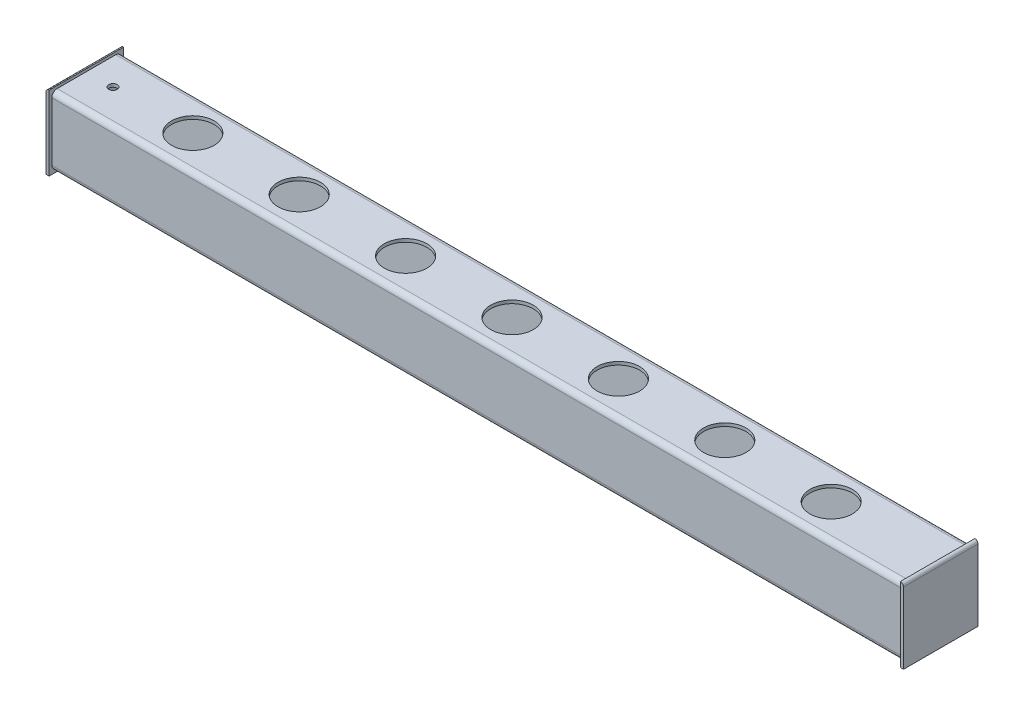
ISO-10303-21;
HEADER;
FILE_DESCRIPTION(('STEP AP214'),'2;1');
FILE_NAME('part.step','',(''),(''),'','','');
FILE_SCHEMA(('AUTOMOTIVE_DESIGN { 1 0 10303 214 1 1 1 1 }'));
ENDSEC;
DATA;
#1=APPLICATION_CONTEXT('core data for automotive mechanical design processes');
#2=APPLICATION_PROTOCOL_DEFINITION('international standard','automotive_design',2000,#1);
#3=PRODUCT_CONTEXT('',#1,'mechanical');
#4=PRODUCT('Part','Part','',(#3));
#5=PRODUCT_RELATED_PRODUCT_CATEGORY('part','',(#4));
#6=PRODUCT_DEFINITION_FORMATION('','',#4);
#7=PRODUCT_DEFINITION_CONTEXT('part definition',#1,'design');
#8=PRODUCT_DEFINITION('design','',#6,#7);
#9=PRODUCT_DEFINITION_SHAPE('','',#8);
#10=(LENGTH_UNIT() NAMED_UNIT(*) SI_UNIT(.MILLI.,.METRE.));
#11=(NAMED_UNIT(*) PLANE_ANGLE_UNIT() SI_UNIT($,.RADIAN.));
#12=(NAMED_UNIT(*) SI_UNIT($,.STERADIAN.) SOLID_ANGLE_UNIT());
#13=UNCERTAINTY_MEASURE_WITH_UNIT(LENGTH_MEASURE(1.E-05),#10,'distance_accuracy_value','');
#14=(GEOMETRIC_REPRESENTATION_CONTEXT(3) GLOBAL_UNCERTAINTY_ASSIGNED_CONTEXT((#13)) GLOBAL_UNIT_ASSIGNED_CONTEXT((#10,
#11,#12)) REPRESENTATION_CONTEXT('',''));
#15=CARTESIAN_POINT('',(0.,0.,0.));
#16=DIRECTION('',(0.,0.,1.));
#17=DIRECTION('',(1.,0.,0.));
#18=AXIS2_PLACEMENT_3D('',#15,#16,#17);
#19=CARTESIAN_POINT('',(-400.,0.,0.));
#20=DIRECTION('',(-1.,0.,0.));
#21=DIRECTION('',(0.,0.,1.));
#22=AXIS2_PLACEMENT_3D('',#19,#20,#21);
#23=PLANE('',#22);
#24=DIRECTION('',(0.,1.,0.));
#25=VECTOR('',#24,1.);
#26=CARTESIAN_POINT('',(-400.,-32.5,-32.5));
#27=LINE('',#26,#25);
#28=CARTESIAN_POINT('',(-400.,-27.5,-32.5));
#29=VERTEX_POINT('',#28);
#30=CARTESIAN_POINT('',(-400.,27.5,-32.5));
#31=VERTEX_POINT('',#30);
#32=EDGE_CURVE('E253',#29,#31,#27,.T.);
#33=ORIENTED_EDGE('',*,*,#32,.F.);
#34=CARTESIAN_POINT('',(-400.,-27.5,-27.5));
#35=DIRECTION('',(-1.,0.,0.));
#36=DIRECTION('',(0.,0.,1.));
#37=AXIS2_PLACEMENT_3D('',#34,#35,#36);
#38=CIRCLE('',#37,5.);
#39=CARTESIAN_POINT('',(-400.,-32.5,-27.5));
#40=VERTEX_POINT('',#39);
#41=EDGE_CURVE('E275',#29,#40,#38,.T.);
#42=ORIENTED_EDGE('',*,*,#41,.T.);
#43=DIRECTION('',(0.,0.,-1.));
#44=VECTOR('',#43,1.);
#45=CARTESIAN_POINT('',(-400.,-32.5,32.5));
#46=LINE('',#45,#44);
#47=CARTESIAN_POINT('',(-400.,-32.5,27.5));
#48=VERTEX_POINT('',#47);
#49=EDGE_CURVE('E243',#48,#40,#46,.T.);
#50=ORIENTED_EDGE('',*,*,#49,.F.);
#51=CARTESIAN_POINT('',(-400.,-27.5,27.5));
#52=DIRECTION('',(-1.,0.,0.));
#53=DIRECTION('',(0.,0.,1.));
#54=AXIS2_PLACEMENT_3D('',#51,#52,#53);
#55=CIRCLE('',#54,5.);
#56=CARTESIAN_POINT('',(-400.,-27.5,32.5));
#57=VERTEX_POINT('',#56);
#58=EDGE_CURVE('E273',#48,#57,#55,.T.);
#59=ORIENTED_EDGE('',*,*,#58,.T.);
#60=DIRECTION('',(0.,-1.,0.));
#61=VECTOR('',#60,1.);
#62=CARTESIAN_POINT('',(-400.,-32.5,32.5));
#63=LINE('',#62,#61);
#64=CARTESIAN_POINT('',(-400.,27.5,32.5));
#65=VERTEX_POINT('',#64);
#66=EDGE_CURVE('E260',#65,#57,#63,.T.);
#67=ORIENTED_EDGE('',*,*,#66,.F.);
#68=CARTESIAN_POINT('',(-400.,27.5,27.5));
#69=DIRECTION('',(-1.,0.,0.));
#70=DIRECTION('',(0.,0.,1.));
#71=AXIS2_PLACEMENT_3D('',#68,#69,#70);
#72=CIRCLE('',#71,5.);
#73=CARTESIAN_POINT('',(-400.,32.5,27.5));
#74=VERTEX_POINT('',#73);
#75=EDGE_CURVE('E269',#65,#74,#72,.T.);
#76=ORIENTED_EDGE('',*,*,#75,.T.);
#77=DIRECTION('',(0.,0.,1.));
#78=VECTOR('',#77,1.);
#79=CARTESIAN_POINT('',(-400.,32.5,32.5));
#80=LINE('',#79,#78);
#81=CARTESIAN_POINT('',(-400.,32.5,-27.5));
#82=VERTEX_POINT('',#81);
#83=EDGE_CURVE('E256',#82,#74,#80,.T.);
#84=ORIENTED_EDGE('',*,*,#83,.F.);
#85=CARTESIAN_POINT('',(-400.,27.5,-27.5));
#86=DIRECTION('',(-1.,0.,0.));
#87=DIRECTION('',(0.,0.,1.));
#88=AXIS2_PLACEMENT_3D('',#85,#86,#87);
#89=CIRCLE('',#88,5.);
#90=EDGE_CURVE('E271',#82,#31,#89,.T.);
#91=ORIENTED_EDGE('',*,*,#90,.T.);
#92=EDGE_LOOP('',(#33,#42,#50,#59,#67,#76,#84,#91));
#93=FACE_BOUND('',#92,.T.);
#94=CARTESIAN_POINT('',(-400.,-27.5,-27.5));
#95=DIRECTION('',(-1.,0.,0.));
#96=DIRECTION('',(0.,0.,1.));
#97=AXIS2_PLACEMENT_3D('',#94,#95,#96);
#98=CIRCLE('',#97,2.);
#99=CARTESIAN_POINT('',(-400.,-27.5,-29.5));
#100=VERTEX_POINT('',#99);
#101=CARTESIAN_POINT('',(-400.,-29.5,-27.5));
#102=VERTEX_POINT('',#101);
#103=EDGE_CURVE('E225',#100,#102,#98,.T.);
#104=ORIENTED_EDGE('',*,*,#103,.F.);
#105=DIRECTION('',(0.,1.,0.));
#106=VECTOR('',#105,1.);
#107=CARTESIAN_POINT('',(-400.,0.,-29.5));
#108=LINE('',#107,#106);
#109=CARTESIAN_POINT('',(-400.,27.5,-29.5));
#110=VERTEX_POINT('',#109);
#111=EDGE_CURVE('E222',#100,#110,#108,.T.);
#112=ORIENTED_EDGE('',*,*,#111,.T.);
#113=CARTESIAN_POINT('',(-400.,27.5,-27.5));
#114=DIRECTION('',(-1.,0.,0.));
#115=DIRECTION('',(0.,0.,1.));
#116=AXIS2_PLACEMENT_3D('',#113,#114,#115);
#117=CIRCLE('',#116,2.);
#118=CARTESIAN_POINT('',(-400.,29.5,-27.5));
#119=VERTEX_POINT('',#118);
#120=EDGE_CURVE('E185',#119,#110,#117,.T.);
#121=ORIENTED_EDGE('',*,*,#120,.F.);
#122=DIRECTION('',(0.,0.,1.));
#123=VECTOR('',#122,1.);
#124=CARTESIAN_POINT('',(-400.,29.5,0.));
#125=LINE('',#124,#123);
#126=CARTESIAN_POINT('',(-400.,29.5,27.5));
#127=VERTEX_POINT('',#126);
#128=EDGE_CURVE('E86',#119,#127,#125,.T.);
#129=ORIENTED_EDGE('',*,*,#128,.T.);
#130=CARTESIAN_POINT('',(-400.,27.5,27.5));
#131=DIRECTION('',(-1.,0.,0.));
#132=DIRECTION('',(0.,0.,1.));
#133=AXIS2_PLACEMENT_3D('',#130,#131,#132);
#134=CIRCLE('',#133,2.);
#135=CARTESIAN_POINT('',(-400.,27.5,29.5));
#136=VERTEX_POINT('',#135);
#137=EDGE_CURVE('E235',#136,#127,#134,.T.);
#138=ORIENTED_EDGE('',*,*,#137,.F.);
#139=DIRECTION('',(0.,-1.,0.));
#140=VECTOR('',#139,1.);
#141=CARTESIAN_POINT('',(-400.,0.,29.5));
#142=LINE('',#141,#140);
#143=CARTESIAN_POINT('',(-400.,-27.5,29.5));
#144=VERTEX_POINT('',#143);
#145=EDGE_CURVE('E231',#136,#144,#142,.T.);
#146=ORIENTED_EDGE('',*,*,#145,.T.);
#147=CARTESIAN_POINT('',(-400.,-27.5,27.5));
#148=DIRECTION('',(-1.,0.,0.));
#149=DIRECTION('',(0.,0.,1.));
#150=AXIS2_PLACEMENT_3D('',#147,#148,#149);
#151=CIRCLE('',#150,2.);
#152=CARTESIAN_POINT('',(-400.,-29.5,27.5));
#153=VERTEX_POINT('',#152);
#154=EDGE_CURVE('E228',#153,#144,#151,.T.);
#155=ORIENTED_EDGE('',*,*,#154,.F.);
#156=DIRECTION('',(0.,0.,-1.));
#157=VECTOR('',#156,1.);
#158=CARTESIAN_POINT('',(-400.,-29.5,0.));
#159=LINE('',#158,#157);
#160=EDGE_CURVE('E199',#153,#102,#159,.T.);
#161=ORIENTED_EDGE('',*,*,#160,.T.);
#162=EDGE_LOOP('',(#104,#112,#121,#129,#138,#146,#155,#161));
#163=FACE_BOUND('',#162,.T.);
#164=ADVANCED_FACE('F62',(#93,#163),#23,.T.);
#165=CARTESIAN_POINT('',(400.,-32.5,-32.5));
#166=DIRECTION('',(0.,0.,1.));
#167=DIRECTION('',(1.,0.,0.));
#168=AXIS2_PLACEMENT_3D('',#165,#166,#167);
#169=PLANE('',#168);
#170=DIRECTION('',(0.,1.,0.));
#171=VECTOR('',#170,1.);
#172=CARTESIAN_POINT('',(400.,-32.5,-32.5));
#173=LINE('',#172,#171);
#174=CARTESIAN_POINT('',(400.,-27.5,-32.5));
#175=VERTEX_POINT('',#174);
#176=CARTESIAN_POINT('',(400.,27.5,-32.5));
#177=VERTEX_POINT('',#176);
#178=EDGE_CURVE('E239',#175,#177,#173,.T.);
#179=ORIENTED_EDGE('',*,*,#178,.F.);
#180=DIRECTION('',(-1.,0.,0.));
#181=VECTOR('',#180,1.);
#182=CARTESIAN_POINT('',(400.,-27.5,-32.5));
#183=LINE('',#182,#181);
#184=EDGE_CURVE('E266',#175,#29,#183,.T.);
#185=ORIENTED_EDGE('',*,*,#184,.T.);
#186=ORIENTED_EDGE('',*,*,#32,.T.);
#187=DIRECTION('',(-1.,0.,0.));
#188=VECTOR('',#187,1.);
#189=CARTESIAN_POINT('',(400.,27.5,-32.5));
#190=LINE('',#189,#188);
#191=EDGE_CURVE('E252',#31,#177,#190,.F.);
#192=ORIENTED_EDGE('',*,*,#191,.T.);
#193=EDGE_LOOP('',(#179,#185,#186,#192));
#194=FACE_BOUND('',#193,.T.);
#195=ADVANCED_FACE('F328',(#194),#169,.F.);
#196=CARTESIAN_POINT('',(400.,32.5,32.5));
#197=DIRECTION('',(0.,-1.,0.));
#198=DIRECTION('',(0.,0.,-1.));
#199=AXIS2_PLACEMENT_3D('',#196,#197,#198);
#200=PLANE('',#199);
#201=CARTESIAN_POINT('',(-375.,32.5,0.));
#202=DIRECTION('',(0.,1.,0.));
#203=DIRECTION('',(0.,0.,1.));
#204=AXIS2_PLACEMENT_3D('',#201,#202,#203);
#205=CIRCLE('',#204,3.99999999999999);
#206=CARTESIAN_POINT('',(-375.,32.5,3.99999999999999));
#207=VERTEX_POINT('',#206);
#208=EDGE_CURVE('E577',#207,#207,#205,.T.);
#209=ORIENTED_EDGE('',*,*,#208,.F.);
#210=EDGE_LOOP('',(#209));
#211=FACE_BOUND('',#210,.T.);
#212=CARTESIAN_POINT('',(300.,32.5,0.));
#213=DIRECTION('',(0.,1.,0.));
#214=DIRECTION('',(0.,0.,1.));
#215=AXIS2_PLACEMENT_3D('',#212,#213,#214);
#216=CIRCLE('',#215,20.);
#217=CARTESIAN_POINT('',(300.,32.5,20.));
#218=VERTEX_POINT('',#217);
#219=EDGE_CURVE('E606',#218,#218,#216,.T.);
#220=ORIENTED_EDGE('',*,*,#219,.F.);
#221=EDGE_LOOP('',(#220));
#222=FACE_BOUND('',#221,.T.);
#223=CARTESIAN_POINT('',(200.,32.5,0.));
#224=DIRECTION('',(0.,1.,0.));
#225=DIRECTION('',(0.,0.,1.));
#226=AXIS2_PLACEMENT_3D('',#223,#224,#225);
#227=CIRCLE('',#226,20.);
#228=CARTESIAN_POINT('',(200.,32.5,20.));
#229=VERTEX_POINT('',#228);
#230=EDGE_CURVE('E600',#229,#229,#227,.T.);
#231=ORIENTED_EDGE('',*,*,#230,.F.);
#232=EDGE_LOOP('',(#231));
#233=FACE_BOUND('',#232,.T.);
#234=CARTESIAN_POINT('',(100.,32.5,0.));
#235=DIRECTION('',(0.,1.,0.));
#236=DIRECTION('',(0.,0.,1.));
#237=AXIS2_PLACEMENT_3D('',#234,#235,#236);
#238=CIRCLE('',#237,20.);
#239=CARTESIAN_POINT('',(100.,32.5,20.));
#240=VERTEX_POINT('',#239);
#241=EDGE_CURVE('E594',#240,#240,#238,.T.);
#242=ORIENTED_EDGE('',*,*,#241,.F.);
#243=EDGE_LOOP('',(#242));
#244=FACE_BOUND('',#243,.T.);
#245=CARTESIAN_POINT('',(-300.,32.5,0.));
#246=DIRECTION('',(0.,1.,0.));
#247=DIRECTION('',(0.,0.,1.));
#248=AXIS2_PLACEMENT_3D('',#245,#246,#247);
#249=CIRCLE('',#248,20.);
#250=CARTESIAN_POINT('',(-300.,32.5,20.));
#251=VERTEX_POINT('',#250);
#252=EDGE_CURVE('E587',#251,#251,#249,.T.);
#253=ORIENTED_EDGE('',*,*,#252,.F.);
#254=EDGE_LOOP('',(#253));
#255=FACE_BOUND('',#254,.T.);
#256=CARTESIAN_POINT('',(-200.,32.5,0.));
#257=DIRECTION('',(0.,1.,0.));
#258=DIRECTION('',(0.,0.,1.));
#259=AXIS2_PLACEMENT_3D('',#256,#257,#258);
#260=CIRCLE('',#259,20.);
#261=CARTESIAN_POINT('',(-200.,32.5,20.));
#262=VERTEX_POINT('',#261);
#263=EDGE_CURVE('E586',#262,#262,#260,.T.);
#264=ORIENTED_EDGE('',*,*,#263,.F.);
#265=EDGE_LOOP('',(#264));
#266=FACE_BOUND('',#265,.T.);
#267=CARTESIAN_POINT('',(-100.,32.5,0.));
#268=DIRECTION('',(0.,1.,0.));
#269=DIRECTION('',(0.,0.,1.));
#270=AXIS2_PLACEMENT_3D('',#267,#268,#269);
#271=CIRCLE('',#270,20.);
#272=CARTESIAN_POINT('',(-100.,32.5,20.));
#273=VERTEX_POINT('',#272);
#274=EDGE_CURVE('E615',#273,#273,#271,.T.);
#275=ORIENTED_EDGE('',*,*,#274,.F.);
#276=EDGE_LOOP('',(#275));
#277=FACE_BOUND('',#276,.T.);
#278=CARTESIAN_POINT('',(0.,32.5,0.));
#279=DIRECTION('',(0.,1.,0.));
#280=DIRECTION('',(0.,0.,1.));
#281=AXIS2_PLACEMENT_3D('',#278,#279,#280);
#282=CIRCLE('',#281,20.);
#283=CARTESIAN_POINT('',(0.,32.5,20.));
#284=VERTEX_POINT('',#283);
#285=EDGE_CURVE('E224',#284,#284,#282,.T.);
#286=ORIENTED_EDGE('',*,*,#285,.F.);
#287=EDGE_LOOP('',(#286));
#288=FACE_BOUND('',#287,.T.);
#289=DIRECTION('',(0.,0.,1.));
#290=VECTOR('',#289,1.);
#291=CARTESIAN_POINT('',(400.,32.5,32.5));
#292=LINE('',#291,#290);
#293=CARTESIAN_POINT('',(400.,32.5,-27.5));
#294=VERTEX_POINT('',#293);
#295=CARTESIAN_POINT('',(400.,32.5,27.5));
#296=VERTEX_POINT('',#295);
#297=EDGE_CURVE('E242',#294,#296,#292,.T.);
#298=ORIENTED_EDGE('',*,*,#297,.F.);
#299=DIRECTION('',(-1.,0.,0.));
#300=VECTOR('',#299,1.);
#301=CARTESIAN_POINT('',(400.,32.5,-27.5));
#302=LINE('',#301,#300);
#303=EDGE_CURVE('E14',#294,#82,#302,.T.);
#304=ORIENTED_EDGE('',*,*,#303,.T.);
#305=ORIENTED_EDGE('',*,*,#83,.T.);
#306=DIRECTION('',(-1.,0.,0.));
#307=VECTOR('',#306,1.);
#308=CARTESIAN_POINT('',(400.,32.5,27.5));
#309=LINE('',#308,#307);
#310=EDGE_CURVE('E71',#74,#296,#309,.F.);
#311=ORIENTED_EDGE('',*,*,#310,.T.);
#312=EDGE_LOOP('',(#298,#304,#305,#311));
#313=FACE_BOUND('',#312,.T.);
#314=ADVANCED_FACE('F298',(#211,#222,#233,#244,#255,#266,#277,#288,#313),#200,.F.);
#315=CARTESIAN_POINT('',(400.,-32.5,32.5));
#316=DIRECTION('',(0.,0.,-1.));
#317=DIRECTION('',(-1.,0.,0.));
#318=AXIS2_PLACEMENT_3D('',#315,#316,#317);
#319=PLANE('',#318);
#320=ORIENTED_EDGE('',*,*,#66,.T.);
#321=DIRECTION('',(-1.,0.,0.));
#322=VECTOR('',#321,1.);
#323=CARTESIAN_POINT('',(400.,-27.5,32.5));
#324=LINE('',#323,#322);
#325=CARTESIAN_POINT('',(400.,-27.5,32.5));
#326=VERTEX_POINT('',#325);
#327=EDGE_CURVE('E293',#57,#326,#324,.F.);
#328=ORIENTED_EDGE('',*,*,#327,.T.);
#329=DIRECTION('',(0.,-1.,0.));
#330=VECTOR('',#329,1.);
#331=CARTESIAN_POINT('',(400.,-32.5,32.5));
#332=LINE('',#331,#330);
#333=CARTESIAN_POINT('',(400.,27.5,32.5));
#334=VERTEX_POINT('',#333);
#335=EDGE_CURVE('E246',#334,#326,#332,.T.);
#336=ORIENTED_EDGE('',*,*,#335,.F.);
#337=DIRECTION('',(-1.,0.,0.));
#338=VECTOR('',#337,1.);
#339=CARTESIAN_POINT('',(400.,27.5,32.5));
#340=LINE('',#339,#338);
#341=EDGE_CURVE('E290',#334,#65,#340,.T.);
#342=ORIENTED_EDGE('',*,*,#341,.T.);
#343=EDGE_LOOP('',(#320,#328,#336,#342));
#344=FACE_BOUND('',#343,.T.);
#345=ADVANCED_FACE('F308',(#344),#319,.F.);
#346=CARTESIAN_POINT('',(400.,-32.5,32.5));
#347=DIRECTION('',(0.,1.,0.));
#348=DIRECTION('',(0.,0.,1.));
#349=AXIS2_PLACEMENT_3D('',#346,#347,#348);
#350=PLANE('',#349);
#351=CARTESIAN_POINT('',(-375.,-32.5,0.));
#352=DIRECTION('',(0.,1.,0.));
#353=DIRECTION('',(0.,0.,1.));
#354=AXIS2_PLACEMENT_3D('',#351,#352,#353);
#355=CIRCLE('',#354,2.);
#356=CARTESIAN_POINT('',(-375.,-32.5,2.));
#357=VERTEX_POINT('',#356);
#358=EDGE_CURVE('E573',#357,#357,#355,.T.);
#359=ORIENTED_EDGE('',*,*,#358,.T.);
#360=EDGE_LOOP('',(#359));
#361=FACE_BOUND('',#360,.T.);
#362=ORIENTED_EDGE('',*,*,#49,.T.);
#363=DIRECTION('',(-1.,0.,0.));
#364=VECTOR('',#363,1.);
#365=CARTESIAN_POINT('',(400.,-32.5,-27.5));
#366=LINE('',#365,#364);
#367=CARTESIAN_POINT('',(400.,-32.5,-27.5));
#368=VERTEX_POINT('',#367);
#369=EDGE_CURVE('E280',#40,#368,#366,.F.);
#370=ORIENTED_EDGE('',*,*,#369,.T.);
#371=DIRECTION('',(0.,0.,-1.));
#372=VECTOR('',#371,1.);
#373=CARTESIAN_POINT('',(400.,-32.5,32.5));
#374=LINE('',#373,#372);
#375=CARTESIAN_POINT('',(400.,-32.5,27.5));
#376=VERTEX_POINT('',#375);
#377=EDGE_CURVE('E249',#376,#368,#374,.T.);
#378=ORIENTED_EDGE('',*,*,#377,.F.);
#379=DIRECTION('',(-1.,0.,0.));
#380=VECTOR('',#379,1.);
#381=CARTESIAN_POINT('',(400.,-32.5,27.5));
#382=LINE('',#381,#380);
#383=EDGE_CURVE('E277',#376,#48,#382,.T.);
#384=ORIENTED_EDGE('',*,*,#383,.T.);
#385=EDGE_LOOP('',(#362,#370,#378,#384));
#386=FACE_BOUND('',#385,.T.);
#387=ADVANCED_FACE('F320',(#361,#386),#350,.F.);
#388=CARTESIAN_POINT('',(400.,0.,0.));
#389=DIRECTION('',(-1.,0.,0.));
#390=DIRECTION('',(0.,0.,1.));
#391=AXIS2_PLACEMENT_3D('',#388,#389,#390);
#392=PLANE('',#391);
#393=DIRECTION('',(0.,0.,-1.));
#394=VECTOR('',#393,1.);
#395=CARTESIAN_POINT('',(400.,-29.5,0.));
#396=LINE('',#395,#394);
#397=CARTESIAN_POINT('',(400.,-29.5,27.5));
#398=VERTEX_POINT('',#397);
#399=CARTESIAN_POINT('',(400.,-29.5,-27.5));
#400=VERTEX_POINT('',#399);
#401=EDGE_CURVE('E190',#398,#400,#396,.T.);
#402=ORIENTED_EDGE('',*,*,#401,.F.);
#403=CARTESIAN_POINT('',(400.,-27.5,27.5));
#404=DIRECTION('',(-1.,0.,0.));
#405=DIRECTION('',(0.,0.,1.));
#406=AXIS2_PLACEMENT_3D('',#403,#404,#405);
#407=CIRCLE('',#406,2.);
#408=CARTESIAN_POINT('',(400.,-27.5,29.5));
#409=VERTEX_POINT('',#408);
#410=EDGE_CURVE('E207',#409,#398,#407,.F.);
#411=ORIENTED_EDGE('',*,*,#410,.F.);
#412=DIRECTION('',(0.,-1.,0.));
#413=VECTOR('',#412,1.);
#414=CARTESIAN_POINT('',(400.,0.,29.5));
#415=LINE('',#414,#413);
#416=CARTESIAN_POINT('',(400.,27.5,29.5));
#417=VERTEX_POINT('',#416);
#418=EDGE_CURVE('E78',#417,#409,#415,.T.);
#419=ORIENTED_EDGE('',*,*,#418,.F.);
#420=CARTESIAN_POINT('',(400.,27.5,27.5));
#421=DIRECTION('',(-1.,0.,0.));
#422=DIRECTION('',(0.,0.,1.));
#423=AXIS2_PLACEMENT_3D('',#420,#421,#422);
#424=CIRCLE('',#423,2.);
#425=CARTESIAN_POINT('',(400.,29.5,27.5));
#426=VERTEX_POINT('',#425);
#427=EDGE_CURVE('E208',#426,#417,#424,.F.);
#428=ORIENTED_EDGE('',*,*,#427,.F.);
#429=DIRECTION('',(0.,0.,1.));
#430=VECTOR('',#429,1.);
#431=CARTESIAN_POINT('',(400.,29.5,0.));
#432=LINE('',#431,#430);
#433=CARTESIAN_POINT('',(400.,29.5,-27.5));
#434=VERTEX_POINT('',#433);
#435=EDGE_CURVE('E198',#434,#426,#432,.T.);
#436=ORIENTED_EDGE('',*,*,#435,.F.);
#437=CARTESIAN_POINT('',(400.,27.5,-27.5));
#438=DIRECTION('',(-1.,0.,0.));
#439=DIRECTION('',(0.,0.,1.));
#440=AXIS2_PLACEMENT_3D('',#437,#438,#439);
#441=CIRCLE('',#440,2.);
#442=CARTESIAN_POINT('',(400.,27.5,-29.5));
#443=VERTEX_POINT('',#442);
#444=EDGE_CURVE('E183',#443,#434,#441,.F.);
#445=ORIENTED_EDGE('',*,*,#444,.F.);
#446=DIRECTION('',(0.,1.,0.));
#447=VECTOR('',#446,1.);
#448=CARTESIAN_POINT('',(400.,0.,-29.5));
#449=LINE('',#448,#447);
#450=CARTESIAN_POINT('',(400.,-27.5,-29.5));
#451=VERTEX_POINT('',#450);
#452=EDGE_CURVE('E194',#451,#443,#449,.T.);
#453=ORIENTED_EDGE('',*,*,#452,.F.);
#454=CARTESIAN_POINT('',(400.,-27.5,-27.5));
#455=DIRECTION('',(-1.,0.,0.));
#456=DIRECTION('',(0.,0.,1.));
#457=AXIS2_PLACEMENT_3D('',#454,#455,#456);
#458=CIRCLE('',#457,2.);
#459=EDGE_CURVE('E210',#400,#451,#458,.F.);
#460=ORIENTED_EDGE('',*,*,#459,.F.);
#461=EDGE_LOOP('',(#402,#411,#419,#428,#436,#445,#453,#460));
#462=FACE_BOUND('',#461,.T.);
#463=ORIENTED_EDGE('',*,*,#377,.T.);
#464=CARTESIAN_POINT('',(400.,-27.5,-27.5));
#465=DIRECTION('',(-1.,0.,0.));
#466=DIRECTION('',(0.,0.,1.));
#467=AXIS2_PLACEMENT_3D('',#464,#465,#466);
#468=CIRCLE('',#467,5.);
#469=EDGE_CURVE('E288',#368,#175,#468,.F.);
#470=ORIENTED_EDGE('',*,*,#469,.T.);
#471=ORIENTED_EDGE('',*,*,#178,.T.);
#472=CARTESIAN_POINT('',(400.,27.5,-27.5));
#473=DIRECTION('',(-1.,0.,0.));
#474=DIRECTION('',(0.,0.,1.));
#475=AXIS2_PLACEMENT_3D('',#472,#473,#474);
#476=CIRCLE('',#475,5.);
#477=EDGE_CURVE('E284',#177,#294,#476,.F.);
#478=ORIENTED_EDGE('',*,*,#477,.T.);
#479=ORIENTED_EDGE('',*,*,#297,.T.);
#480=CARTESIAN_POINT('',(400.,27.5,27.5));
#481=DIRECTION('',(-1.,0.,0.));
#482=DIRECTION('',(0.,0.,1.));
#483=AXIS2_PLACEMENT_3D('',#480,#481,#482);
#484=CIRCLE('',#483,5.);
#485=EDGE_CURVE('E282',#296,#334,#484,.F.);
#486=ORIENTED_EDGE('',*,*,#485,.T.);
#487=ORIENTED_EDGE('',*,*,#335,.T.);
#488=CARTESIAN_POINT('',(400.,-27.5,27.5));
#489=DIRECTION('',(-1.,0.,0.));
#490=DIRECTION('',(0.,0.,1.));
#491=AXIS2_PLACEMENT_3D('',#488,#489,#490);
#492=CIRCLE('',#491,5.);
#493=EDGE_CURVE('E286',#326,#376,#492,.F.);
#494=ORIENTED_EDGE('',*,*,#493,.T.);
#495=EDGE_LOOP('',(#463,#470,#471,#478,#479,#486,#487,#494));
#496=FACE_BOUND('',#495,.T.);
#497=ADVANCED_FACE('F203',(#462,#496),#392,.F.);
#498=CARTESIAN_POINT('',(400.,-27.5,-27.5));
#499=DIRECTION('',(-1.,0.,0.));
#500=DIRECTION('',(0.,0.,1.));
#501=AXIS2_PLACEMENT_3D('',#498,#499,#500);
#502=CYLINDRICAL_SURFACE('',#501,5.);
#503=ORIENTED_EDGE('',*,*,#469,.F.);
#504=ORIENTED_EDGE('',*,*,#369,.F.);
#505=ORIENTED_EDGE('',*,*,#41,.F.);
#506=ORIENTED_EDGE('',*,*,#184,.F.);
#507=EDGE_LOOP('',(#503,#504,#505,#506));
#508=FACE_BOUND('',#507,.T.);
#509=ADVANCED_FACE('F326',(#508),#502,.T.);
#510=CARTESIAN_POINT('',(400.,-27.5,27.5));
#511=DIRECTION('',(-1.,0.,0.));
#512=DIRECTION('',(0.,0.,1.));
#513=AXIS2_PLACEMENT_3D('',#510,#511,#512);
#514=CYLINDRICAL_SURFACE('',#513,5.);
#515=ORIENTED_EDGE('',*,*,#493,.F.);
#516=ORIENTED_EDGE('',*,*,#327,.F.);
#517=ORIENTED_EDGE('',*,*,#58,.F.);
#518=ORIENTED_EDGE('',*,*,#383,.F.);
#519=EDGE_LOOP('',(#515,#516,#517,#518));
#520=FACE_BOUND('',#519,.T.);
#521=ADVANCED_FACE('F317',(#520),#514,.T.);
#522=CARTESIAN_POINT('',(400.,27.5,-27.5));
#523=DIRECTION('',(-1.,0.,0.));
#524=DIRECTION('',(0.,0.,1.));
#525=AXIS2_PLACEMENT_3D('',#522,#523,#524);
#526=CYLINDRICAL_SURFACE('',#525,5.);
#527=ORIENTED_EDGE('',*,*,#477,.F.);
#528=ORIENTED_EDGE('',*,*,#191,.F.);
#529=ORIENTED_EDGE('',*,*,#90,.F.);
#530=ORIENTED_EDGE('',*,*,#303,.F.);
#531=EDGE_LOOP('',(#527,#528,#529,#530));
#532=FACE_BOUND('',#531,.T.);
#533=ADVANCED_FACE('F331',(#532),#526,.T.);
#534=CARTESIAN_POINT('',(400.,27.5,27.5));
#535=DIRECTION('',(-1.,0.,0.));
#536=DIRECTION('',(0.,0.,1.));
#537=AXIS2_PLACEMENT_3D('',#534,#535,#536);
#538=CYLINDRICAL_SURFACE('',#537,5.);
#539=ORIENTED_EDGE('',*,*,#485,.F.);
#540=ORIENTED_EDGE('',*,*,#310,.F.);
#541=ORIENTED_EDGE('',*,*,#75,.F.);
#542=ORIENTED_EDGE('',*,*,#341,.F.);
#543=EDGE_LOOP('',(#539,#540,#541,#542));
#544=FACE_BOUND('',#543,.T.);
#545=ADVANCED_FACE('F64',(#544),#538,.T.);
#546=CARTESIAN_POINT('',(400.,-32.5,-29.5));
#547=DIRECTION('',(0.,0.,1.));
#548=DIRECTION('',(1.,0.,0.));
#549=AXIS2_PLACEMENT_3D('',#546,#547,#548);
#550=PLANE('',#549);
#551=ORIENTED_EDGE('',*,*,#452,.T.);
#552=DIRECTION('',(1.,0.,0.));
#553=VECTOR('',#552,1.);
#554=CARTESIAN_POINT('',(400.,27.5,-29.5));
#555=LINE('',#554,#553);
#556=EDGE_CURVE('E179',#110,#443,#555,.T.);
#557=ORIENTED_EDGE('',*,*,#556,.F.);
#558=ORIENTED_EDGE('',*,*,#111,.F.);
#559=DIRECTION('',(1.,0.,0.));
#560=VECTOR('',#559,1.);
#561=CARTESIAN_POINT('',(400.,-27.5,-29.5));
#562=LINE('',#561,#560);
#563=EDGE_CURVE('E189',#451,#100,#562,.F.);
#564=ORIENTED_EDGE('',*,*,#563,.F.);
#565=EDGE_LOOP('',(#551,#557,#558,#564));
#566=FACE_BOUND('',#565,.T.);
#567=ADVANCED_FACE('F195',(#566),#550,.T.);
#568=CARTESIAN_POINT('',(400.,29.5,32.5));
#569=DIRECTION('',(0.,-1.,0.));
#570=DIRECTION('',(0.,0.,-1.));
#571=AXIS2_PLACEMENT_3D('',#568,#569,#570);
#572=PLANE('',#571);
#573=CARTESIAN_POINT('',(-375.,29.5,0.));
#574=DIRECTION('',(0.,-1.,0.));
#575=DIRECTION('',(0.,0.,-1.));
#576=AXIS2_PLACEMENT_3D('',#573,#574,#575);
#577=CIRCLE('',#576,3.99999999999999);
#578=CARTESIAN_POINT('',(-375.,29.5,-3.99999999999999));
#579=VERTEX_POINT('',#578);
#580=EDGE_CURVE('E574',#579,#579,#577,.F.);
#581=ORIENTED_EDGE('',*,*,#580,.T.);
#582=EDGE_LOOP('',(#581));
#583=FACE_BOUND('',#582,.T.);
#584=CARTESIAN_POINT('',(300.,29.5,0.));
#585=DIRECTION('',(0.,-1.,0.));
#586=DIRECTION('',(0.,0.,-1.));
#587=AXIS2_PLACEMENT_3D('',#584,#585,#586);
#588=CIRCLE('',#587,20.);
#589=CARTESIAN_POINT('',(300.,29.5,-20.));
#590=VERTEX_POINT('',#589);
#591=EDGE_CURVE('E582',#590,#590,#588,.F.);
#592=ORIENTED_EDGE('',*,*,#591,.T.);
#593=EDGE_LOOP('',(#592));
#594=FACE_BOUND('',#593,.T.);
#595=CARTESIAN_POINT('',(200.,29.5,0.));
#596=DIRECTION('',(0.,-1.,0.));
#597=DIRECTION('',(0.,0.,-1.));
#598=AXIS2_PLACEMENT_3D('',#595,#596,#597);
#599=CIRCLE('',#598,20.);
#600=CARTESIAN_POINT('',(200.,29.5,-20.));
#601=VERTEX_POINT('',#600);
#602=EDGE_CURVE('E603',#601,#601,#599,.F.);
#603=ORIENTED_EDGE('',*,*,#602,.T.);
#604=EDGE_LOOP('',(#603));
#605=FACE_BOUND('',#604,.T.);
#606=CARTESIAN_POINT('',(100.,29.5,0.));
#607=DIRECTION('',(0.,-1.,0.));
#608=DIRECTION('',(0.,0.,-1.));
#609=AXIS2_PLACEMENT_3D('',#606,#607,#608);
#610=CIRCLE('',#609,20.);
#611=CARTESIAN_POINT('',(100.,29.5,-20.));
#612=VERTEX_POINT('',#611);
#613=EDGE_CURVE('E597',#612,#612,#610,.F.);
#614=ORIENTED_EDGE('',*,*,#613,.T.);
#615=EDGE_LOOP('',(#614));
#616=FACE_BOUND('',#615,.T.);
#617=CARTESIAN_POINT('',(-300.,29.5,0.));
#618=DIRECTION('',(0.,-1.,0.));
#619=DIRECTION('',(0.,0.,-1.));
#620=AXIS2_PLACEMENT_3D('',#617,#618,#619);
#621=CIRCLE('',#620,20.);
#622=CARTESIAN_POINT('',(-300.,29.5,-20.));
#623=VERTEX_POINT('',#622);
#624=EDGE_CURVE('E591',#623,#623,#621,.F.);
#625=ORIENTED_EDGE('',*,*,#624,.T.);
#626=EDGE_LOOP('',(#625));
#627=FACE_BOUND('',#626,.T.);
#628=CARTESIAN_POINT('',(-200.,29.5,0.));
#629=DIRECTION('',(0.,-1.,0.));
#630=DIRECTION('',(0.,0.,-1.));
#631=AXIS2_PLACEMENT_3D('',#628,#629,#630);
#632=CIRCLE('',#631,20.);
#633=CARTESIAN_POINT('',(-200.,29.5,-20.));
#634=VERTEX_POINT('',#633);
#635=EDGE_CURVE('E583',#634,#634,#632,.F.);
#636=ORIENTED_EDGE('',*,*,#635,.T.);
#637=EDGE_LOOP('',(#636));
#638=FACE_BOUND('',#637,.T.);
#639=CARTESIAN_POINT('',(-100.,29.5,0.));
#640=DIRECTION('',(0.,-1.,0.));
#641=DIRECTION('',(0.,0.,-1.));
#642=AXIS2_PLACEMENT_3D('',#639,#640,#641);
#643=CIRCLE('',#642,20.);
#644=CARTESIAN_POINT('',(-100.,29.5,-20.));
#645=VERTEX_POINT('',#644);
#646=EDGE_CURVE('E590',#645,#645,#643,.F.);
#647=ORIENTED_EDGE('',*,*,#646,.T.);
#648=EDGE_LOOP('',(#647));
#649=FACE_BOUND('',#648,.T.);
#650=CARTESIAN_POINT('',(0.,29.5,0.));
#651=DIRECTION('',(0.,-1.,0.));
#652=DIRECTION('',(0.,0.,-1.));
#653=AXIS2_PLACEMENT_3D('',#650,#651,#652);
#654=CIRCLE('',#653,20.);
#655=CARTESIAN_POINT('',(0.,29.5,-20.));
#656=VERTEX_POINT('',#655);
#657=EDGE_CURVE('E618',#656,#656,#654,.F.);
#658=ORIENTED_EDGE('',*,*,#657,.T.);
#659=EDGE_LOOP('',(#658));
#660=FACE_BOUND('',#659,.T.);
#661=ORIENTED_EDGE('',*,*,#435,.T.);
#662=DIRECTION('',(1.,0.,0.));
#663=VECTOR('',#662,1.);
#664=CARTESIAN_POINT('',(400.,29.5,27.5));
#665=LINE('',#664,#663);
#666=EDGE_CURVE('E628',#127,#426,#665,.T.);
#667=ORIENTED_EDGE('',*,*,#666,.F.);
#668=ORIENTED_EDGE('',*,*,#128,.F.);
#669=DIRECTION('',(1.,0.,0.));
#670=VECTOR('',#669,1.);
#671=CARTESIAN_POINT('',(400.,29.5,-27.5));
#672=LINE('',#671,#670);
#673=EDGE_CURVE('E257',#434,#119,#672,.F.);
#674=ORIENTED_EDGE('',*,*,#673,.F.);
#675=EDGE_LOOP('',(#661,#667,#668,#674));
#676=FACE_BOUND('',#675,.T.);
#677=ADVANCED_FACE('F410',(#583,#594,#605,#616,#627,#638,#649,#660,#676),#572,.T.);
#678=CARTESIAN_POINT('',(400.,-32.5,29.5));
#679=DIRECTION('',(0.,0.,-1.));
#680=DIRECTION('',(-1.,0.,0.));
#681=AXIS2_PLACEMENT_3D('',#678,#679,#680);
#682=PLANE('',#681);
#683=ORIENTED_EDGE('',*,*,#145,.F.);
#684=DIRECTION('',(-1.,0.,0.));
#685=VECTOR('',#684,1.);
#686=CARTESIAN_POINT('',(400.,27.5,29.5));
#687=LINE('',#686,#685);
#688=EDGE_CURVE('E221',#417,#136,#687,.T.);
#689=ORIENTED_EDGE('',*,*,#688,.F.);
#690=ORIENTED_EDGE('',*,*,#418,.T.);
#691=DIRECTION('',(-1.,0.,0.));
#692=VECTOR('',#691,1.);
#693=CARTESIAN_POINT('',(400.,-27.5,29.5));
#694=LINE('',#693,#692);
#695=EDGE_CURVE('E626',#144,#409,#694,.F.);
#696=ORIENTED_EDGE('',*,*,#695,.F.);
#697=EDGE_LOOP('',(#683,#689,#690,#696));
#698=FACE_BOUND('',#697,.T.);
#699=ADVANCED_FACE('F420',(#698),#682,.T.);
#700=CARTESIAN_POINT('',(400.,-29.5,32.5));
#701=DIRECTION('',(0.,1.,0.));
#702=DIRECTION('',(0.,0.,1.));
#703=AXIS2_PLACEMENT_3D('',#700,#701,#702);
#704=PLANE('',#703);
#705=CARTESIAN_POINT('',(-375.,-29.5,0.));
#706=DIRECTION('',(0.,1.,0.));
#707=DIRECTION('',(0.,0.,1.));
#708=AXIS2_PLACEMENT_3D('',#705,#706,#707);
#709=CIRCLE('',#708,2.);
#710=CARTESIAN_POINT('',(-375.,-29.5,2.));
#711=VERTEX_POINT('',#710);
#712=EDGE_CURVE('E66',#711,#711,#709,.T.);
#713=ORIENTED_EDGE('',*,*,#712,.F.);
#714=EDGE_LOOP('',(#713));
#715=FACE_BOUND('',#714,.T.);
#716=ORIENTED_EDGE('',*,*,#160,.F.);
#717=DIRECTION('',(1.,0.,0.));
#718=VECTOR('',#717,1.);
#719=CARTESIAN_POINT('',(400.,-29.5,27.5));
#720=LINE('',#719,#718);
#721=EDGE_CURVE('E227',#398,#153,#720,.F.);
#722=ORIENTED_EDGE('',*,*,#721,.F.);
#723=ORIENTED_EDGE('',*,*,#401,.T.);
#724=DIRECTION('',(1.,0.,0.));
#725=VECTOR('',#724,1.);
#726=CARTESIAN_POINT('',(400.,-29.5,-27.5));
#727=LINE('',#726,#725);
#728=EDGE_CURVE('E212',#102,#400,#727,.T.);
#729=ORIENTED_EDGE('',*,*,#728,.F.);
#730=EDGE_LOOP('',(#716,#722,#723,#729));
#731=FACE_BOUND('',#730,.T.);
#732=ADVANCED_FACE('F431',(#715,#731),#704,.T.);
#733=CARTESIAN_POINT('',(400.,-27.5,-27.5));
#734=DIRECTION('',(-1.,0.,0.));
#735=DIRECTION('',(0.,0.,1.));
#736=AXIS2_PLACEMENT_3D('',#733,#734,#735);
#737=CYLINDRICAL_SURFACE('',#736,2.);
#738=ORIENTED_EDGE('',*,*,#459,.T.);
#739=ORIENTED_EDGE('',*,*,#563,.T.);
#740=ORIENTED_EDGE('',*,*,#103,.T.);
#741=ORIENTED_EDGE('',*,*,#728,.T.);
#742=EDGE_LOOP('',(#738,#739,#740,#741));
#743=FACE_BOUND('',#742,.T.);
#744=ADVANCED_FACE('F441',(#743),#737,.F.);
#745=CARTESIAN_POINT('',(400.,-27.5,27.5));
#746=DIRECTION('',(-1.,0.,0.));
#747=DIRECTION('',(0.,0.,1.));
#748=AXIS2_PLACEMENT_3D('',#745,#746,#747);
#749=CYLINDRICAL_SURFACE('',#748,2.);
#750=ORIENTED_EDGE('',*,*,#410,.T.);
#751=ORIENTED_EDGE('',*,*,#721,.T.);
#752=ORIENTED_EDGE('',*,*,#154,.T.);
#753=ORIENTED_EDGE('',*,*,#695,.T.);
#754=EDGE_LOOP('',(#750,#751,#752,#753));
#755=FACE_BOUND('',#754,.T.);
#756=ADVANCED_FACE('F451',(#755),#749,.F.);
#757=CARTESIAN_POINT('',(400.,27.5,-27.5));
#758=DIRECTION('',(-1.,0.,0.));
#759=DIRECTION('',(0.,0.,1.));
#760=AXIS2_PLACEMENT_3D('',#757,#758,#759);
#761=CYLINDRICAL_SURFACE('',#760,2.);
#762=ORIENTED_EDGE('',*,*,#444,.T.);
#763=ORIENTED_EDGE('',*,*,#673,.T.);
#764=ORIENTED_EDGE('',*,*,#120,.T.);
#765=ORIENTED_EDGE('',*,*,#556,.T.);
#766=EDGE_LOOP('',(#762,#763,#764,#765));
#767=FACE_BOUND('',#766,.T.);
#768=ADVANCED_FACE('F181',(#767),#761,.F.);
#769=CARTESIAN_POINT('',(400.,27.5,27.5));
#770=DIRECTION('',(-1.,0.,0.));
#771=DIRECTION('',(0.,0.,1.));
#772=AXIS2_PLACEMENT_3D('',#769,#770,#771);
#773=CYLINDRICAL_SURFACE('',#772,2.);
#774=ORIENTED_EDGE('',*,*,#427,.T.);
#775=ORIENTED_EDGE('',*,*,#688,.T.);
#776=ORIENTED_EDGE('',*,*,#137,.T.);
#777=ORIENTED_EDGE('',*,*,#666,.T.);
#778=EDGE_LOOP('',(#774,#775,#776,#777));
#779=FACE_BOUND('',#778,.T.);
#780=ADVANCED_FACE('F470',(#779),#773,.F.);
#781=CARTESIAN_POINT('',(0.,-35.001,0.));
#782=DIRECTION('',(0.,1.,0.));
#783=DIRECTION('',(0.,0.,1.));
#784=AXIS2_PLACEMENT_3D('',#781,#782,#783);
#785=CYLINDRICAL_SURFACE('',#784,20.);
#786=ORIENTED_EDGE('',*,*,#657,.F.);
#787=EDGE_LOOP('',(#786));
#788=FACE_BOUND('',#787,.T.);
#789=ORIENTED_EDGE('',*,*,#285,.T.);
#790=EDGE_LOOP('',(#789));
#791=FACE_BOUND('',#790,.T.);
#792=ADVANCED_FACE('F479',(#788,#791),#785,.F.);
#793=CARTESIAN_POINT('',(-100.,-35.001,0.));
#794=DIRECTION('',(0.,1.,0.));
#795=DIRECTION('',(0.,0.,1.));
#796=AXIS2_PLACEMENT_3D('',#793,#794,#795);
#797=CYLINDRICAL_SURFACE('',#796,20.);
#798=ORIENTED_EDGE('',*,*,#646,.F.);
#799=EDGE_LOOP('',(#798));
#800=FACE_BOUND('',#799,.T.);
#801=ORIENTED_EDGE('',*,*,#274,.T.);
#802=EDGE_LOOP('',(#801));
#803=FACE_BOUND('',#802,.T.);
#804=ADVANCED_FACE('F488',(#800,#803),#797,.F.);
#805=CARTESIAN_POINT('',(-200.,-35.001,0.));
#806=DIRECTION('',(0.,1.,0.));
#807=DIRECTION('',(0.,0.,1.));
#808=AXIS2_PLACEMENT_3D('',#805,#806,#807);
#809=CYLINDRICAL_SURFACE('',#808,20.);
#810=ORIENTED_EDGE('',*,*,#635,.F.);
#811=EDGE_LOOP('',(#810));
#812=FACE_BOUND('',#811,.T.);
#813=ORIENTED_EDGE('',*,*,#263,.T.);
#814=EDGE_LOOP('',(#813));
#815=FACE_BOUND('',#814,.T.);
#816=ADVANCED_FACE('F498',(#812,#815),#809,.F.);
#817=CARTESIAN_POINT('',(-300.,-35.001,0.));
#818=DIRECTION('',(0.,1.,0.));
#819=DIRECTION('',(0.,0.,1.));
#820=AXIS2_PLACEMENT_3D('',#817,#818,#819);
#821=CYLINDRICAL_SURFACE('',#820,20.);
#822=ORIENTED_EDGE('',*,*,#624,.F.);
#823=EDGE_LOOP('',(#822));
#824=FACE_BOUND('',#823,.T.);
#825=ORIENTED_EDGE('',*,*,#252,.T.);
#826=EDGE_LOOP('',(#825));
#827=FACE_BOUND('',#826,.T.);
#828=ADVANCED_FACE('F508',(#824,#827),#821,.F.);
#829=CARTESIAN_POINT('',(100.,-35.001,0.));
#830=DIRECTION('',(0.,1.,0.));
#831=DIRECTION('',(0.,0.,1.));
#832=AXIS2_PLACEMENT_3D('',#829,#830,#831);
#833=CYLINDRICAL_SURFACE('',#832,20.);
#834=ORIENTED_EDGE('',*,*,#613,.F.);
#835=EDGE_LOOP('',(#834));
#836=FACE_BOUND('',#835,.T.);
#837=ORIENTED_EDGE('',*,*,#241,.T.);
#838=EDGE_LOOP('',(#837));
#839=FACE_BOUND('',#838,.T.);
#840=ADVANCED_FACE('F518',(#836,#839),#833,.F.);
#841=CARTESIAN_POINT('',(200.,-35.001,0.));
#842=DIRECTION('',(0.,1.,0.));
#843=DIRECTION('',(0.,0.,1.));
#844=AXIS2_PLACEMENT_3D('',#841,#842,#843);
#845=CYLINDRICAL_SURFACE('',#844,20.);
#846=ORIENTED_EDGE('',*,*,#602,.F.);
#847=EDGE_LOOP('',(#846));
#848=FACE_BOUND('',#847,.T.);
#849=ORIENTED_EDGE('',*,*,#230,.T.);
#850=EDGE_LOOP('',(#849));
#851=FACE_BOUND('',#850,.T.);
#852=ADVANCED_FACE('F528',(#848,#851),#845,.F.);
#853=CARTESIAN_POINT('',(300.,-35.001,0.));
#854=DIRECTION('',(0.,1.,0.));
#855=DIRECTION('',(0.,0.,1.));
#856=AXIS2_PLACEMENT_3D('',#853,#854,#855);
#857=CYLINDRICAL_SURFACE('',#856,20.);
#858=ORIENTED_EDGE('',*,*,#591,.F.);
#859=EDGE_LOOP('',(#858));
#860=FACE_BOUND('',#859,.T.);
#861=ORIENTED_EDGE('',*,*,#219,.T.);
#862=EDGE_LOOP('',(#861));
#863=FACE_BOUND('',#862,.T.);
#864=ADVANCED_FACE('F538',(#860,#863),#857,.F.);
#865=CARTESIAN_POINT('',(-375.,-35.001,0.));
#866=DIRECTION('',(0.,1.,0.));
#867=DIRECTION('',(0.,0.,1.));
#868=AXIS2_PLACEMENT_3D('',#865,#866,#867);
#869=CYLINDRICAL_SURFACE('',#868,3.99999999999999);
#870=ORIENTED_EDGE('',*,*,#580,.F.);
#871=EDGE_LOOP('',(#870));
#872=FACE_BOUND('',#871,.T.);
#873=ORIENTED_EDGE('',*,*,#208,.T.);
#874=EDGE_LOOP('',(#873));
#875=FACE_BOUND('',#874,.T.);
#876=ADVANCED_FACE('F547',(#872,#875),#869,.F.);
#877=CARTESIAN_POINT('',(-375.,-35.,0.));
#878=DIRECTION('',(0.,1.,0.));
#879=DIRECTION('',(0.,0.,1.));
#880=AXIS2_PLACEMENT_3D('',#877,#878,#879);
#881=CYLINDRICAL_SURFACE('',#880,2.);
#882=ORIENTED_EDGE('',*,*,#712,.T.);
#883=EDGE_LOOP('',(#882));
#884=FACE_BOUND('',#883,.T.);
#885=ORIENTED_EDGE('',*,*,#358,.F.);
#886=EDGE_LOOP('',(#885));
#887=FACE_BOUND('',#886,.T.);
#888=ADVANCED_FACE('F556',(#884,#887),#881,.F.);
#889=CLOSED_SHELL('',(#164,#195,#314,#345,#387,#497,#509,#521,#533,#545,#567,#677,#699,#732,
#744,#756,#768,#780,#792,#804,#816,#828,#840,#852,#864,#876,#888));
#890=MANIFOLD_SOLID_BREP('B2',#889);
#891=CARTESIAN_POINT('',(-403.,-35.,-35.));
#892=DIRECTION('',(0.,0.,1.));
#893=DIRECTION('',(-1.,0.,0.));
#894=AXIS2_PLACEMENT_3D('',#891,#892,#893);
#895=PLANE('',#894);
#896=DIRECTION('',(0.,1.,0.));
#897=VECTOR('',#896,1.);
#898=CARTESIAN_POINT('',(-400.,-35.,-35.));
#899=LINE('',#898,#897);
#900=CARTESIAN_POINT('',(-400.,-35.,-35.));
#901=VERTEX_POINT('',#900);
#902=CARTESIAN_POINT('',(-400.,35.,-35.));
#903=VERTEX_POINT('',#902);
#904=EDGE_CURVE('E759',#901,#903,#899,.T.);
#905=ORIENTED_EDGE('',*,*,#904,.F.);
#906=DIRECTION('',(1.,0.,0.));
#907=VECTOR('',#906,1.);
#908=CARTESIAN_POINT('',(-403.,-35.,-35.));
#909=LINE('',#908,#907);
#910=CARTESIAN_POINT('',(-403.,-35.,-35.));
#911=VERTEX_POINT('',#910);
#912=EDGE_CURVE('E745',#911,#901,#909,.T.);
#913=ORIENTED_EDGE('',*,*,#912,.F.);
#914=DIRECTION('',(0.,1.,0.));
#915=VECTOR('',#914,1.);
#916=CARTESIAN_POINT('',(-403.,-35.,-35.));
#917=LINE('',#916,#915);
#918=CARTESIAN_POINT('',(-403.,32.,-35.));
#919=VERTEX_POINT('',#918);
#920=EDGE_CURVE('E741',#911,#919,#917,.T.);
#921=ORIENTED_EDGE('',*,*,#920,.T.);
#922=CARTESIAN_POINT('',(-400.,32.,-35.));
#923=DIRECTION('',(0.,0.,-1.));
#924=DIRECTION('',(-1.,0.,0.));
#925=AXIS2_PLACEMENT_3D('',#922,#923,#924);
#926=CIRCLE('',#925,3.);
#927=EDGE_CURVE('E60',#903,#919,#926,.F.);
#928=ORIENTED_EDGE('',*,*,#927,.F.);
#929=EDGE_LOOP('',(#905,#913,#921,#928));
#930=FACE_BOUND('',#929,.T.);
#931=ADVANCED_FACE('F698',(#930),#895,.F.);
#932=CARTESIAN_POINT('',(-403.,-35.,35.));
#933=DIRECTION('',(0.,0.,-1.));
#934=DIRECTION('',(1.,0.,0.));
#935=AXIS2_PLACEMENT_3D('',#932,#933,#934);
#936=PLANE('',#935);
#937=DIRECTION('',(0.,-1.,0.));
#938=VECTOR('',#937,1.);
#939=CARTESIAN_POINT('',(-403.,-35.,35.));
#940=LINE('',#939,#938);
#941=CARTESIAN_POINT('',(-403.,32.,35.));
#942=VERTEX_POINT('',#941);
#943=CARTESIAN_POINT('',(-403.,-35.,35.));
#944=VERTEX_POINT('',#943);
#945=EDGE_CURVE('E739',#942,#944,#940,.T.);
#946=ORIENTED_EDGE('',*,*,#945,.T.);
#947=DIRECTION('',(1.,0.,0.));
#948=VECTOR('',#947,1.);
#949=CARTESIAN_POINT('',(-403.,-35.,35.));
#950=LINE('',#949,#948);
#951=CARTESIAN_POINT('',(-400.,-35.,35.));
#952=VERTEX_POINT('',#951);
#953=EDGE_CURVE('E748',#944,#952,#950,.T.);
#954=ORIENTED_EDGE('',*,*,#953,.T.);
#955=DIRECTION('',(0.,-1.,0.));
#956=VECTOR('',#955,1.);
#957=CARTESIAN_POINT('',(-400.,-35.,35.));
#958=LINE('',#957,#956);
#959=CARTESIAN_POINT('',(-400.,35.,35.));
#960=VERTEX_POINT('',#959);
#961=EDGE_CURVE('E764',#960,#952,#958,.T.);
#962=ORIENTED_EDGE('',*,*,#961,.F.);
#963=CARTESIAN_POINT('',(-400.,32.,35.));
#964=DIRECTION('',(0.,0.,1.));
#965=DIRECTION('',(1.,0.,0.));
#966=AXIS2_PLACEMENT_3D('',#963,#964,#965);
#967=CIRCLE('',#966,3.);
#968=EDGE_CURVE('E706',#942,#960,#967,.F.);
#969=ORIENTED_EDGE('',*,*,#968,.F.);
#970=EDGE_LOOP('',(#946,#954,#962,#969));
#971=FACE_BOUND('',#970,.T.);
#972=ADVANCED_FACE('F755',(#971),#936,.F.);
#973=CARTESIAN_POINT('',(-403.,-35.,35.));
#974=DIRECTION('',(0.,1.,0.));
#975=DIRECTION('',(0.,0.,1.));
#976=AXIS2_PLACEMENT_3D('',#973,#974,#975);
#977=PLANE('',#976);
#978=DIRECTION('',(0.,0.,-1.));
#979=VECTOR('',#978,1.);
#980=CARTESIAN_POINT('',(-400.,-35.,35.));
#981=LINE('',#980,#979);
#982=EDGE_CURVE('E750',#952,#901,#981,.T.);
#983=ORIENTED_EDGE('',*,*,#982,.F.);
#984=ORIENTED_EDGE('',*,*,#953,.F.);
#985=DIRECTION('',(0.,0.,-1.));
#986=VECTOR('',#985,1.);
#987=CARTESIAN_POINT('',(-403.,-35.,35.));
#988=LINE('',#987,#986);
#989=EDGE_CURVE('E735',#944,#911,#988,.T.);
#990=ORIENTED_EDGE('',*,*,#989,.T.);
#991=ORIENTED_EDGE('',*,*,#912,.T.);
#992=EDGE_LOOP('',(#983,#984,#990,#991));
#993=FACE_BOUND('',#992,.T.);
#994=ADVANCED_FACE('F749',(#993),#977,.F.);
#995=CARTESIAN_POINT('',(-403.,0.,0.));
#996=DIRECTION('',(1.,0.,0.));
#997=DIRECTION('',(0.,0.,1.));
#998=AXIS2_PLACEMENT_3D('',#995,#996,#997);
#999=PLANE('',#998);
#1000=ORIENTED_EDGE('',*,*,#920,.F.);
#1001=ORIENTED_EDGE('',*,*,#989,.F.);
#1002=ORIENTED_EDGE('',*,*,#945,.F.);
#1003=DIRECTION('',(0.,0.,1.));
#1004=VECTOR('',#1003,1.);
#1005=CARTESIAN_POINT('',(-403.,32.,0.));
#1006=LINE('',#1005,#1004);
#1007=EDGE_CURVE('E712',#919,#942,#1006,.T.);
#1008=ORIENTED_EDGE('',*,*,#1007,.F.);
#1009=EDGE_LOOP('',(#1000,#1001,#1002,#1008));
#1010=FACE_BOUND('',#1009,.T.);
#1011=ADVANCED_FACE('F737',(#1010),#999,.F.);
#1012=CARTESIAN_POINT('',(-400.,0.,0.));
#1013=DIRECTION('',(1.,0.,0.));
#1014=DIRECTION('',(0.,0.,1.));
#1015=AXIS2_PLACEMENT_3D('',#1012,#1013,#1014);
#1016=PLANE('',#1015);
#1017=ORIENTED_EDGE('',*,*,#904,.T.);
#1018=DIRECTION('',(0.,0.,1.));
#1019=VECTOR('',#1018,1.);
#1020=CARTESIAN_POINT('',(-400.,35.,35.));
#1021=LINE('',#1020,#1019);
#1022=EDGE_CURVE('E762',#903,#960,#1021,.T.);
#1023=ORIENTED_EDGE('',*,*,#1022,.T.);
#1024=ORIENTED_EDGE('',*,*,#961,.T.);
#1025=ORIENTED_EDGE('',*,*,#982,.T.);
#1026=EDGE_LOOP('',(#1017,#1023,#1024,#1025));
#1027=FACE_BOUND('',#1026,.T.);
#1028=ADVANCED_FACE('F770',(#1027),#1016,.T.);
#1029=CARTESIAN_POINT('',(-400.,32.,0.));
#1030=DIRECTION('',(0.,0.,1.));
#1031=DIRECTION('',(-1.,0.,0.));
#1032=AXIS2_PLACEMENT_3D('',#1029,#1030,#1031);
#1033=CYLINDRICAL_SURFACE('',#1032,3.);
#1034=ORIENTED_EDGE('',*,*,#927,.T.);
#1035=ORIENTED_EDGE('',*,*,#1007,.T.);
#1036=ORIENTED_EDGE('',*,*,#968,.T.);
#1037=ORIENTED_EDGE('',*,*,#1022,.F.);
#1038=EDGE_LOOP('',(#1034,#1035,#1036,#1037));
#1039=FACE_BOUND('',#1038,.T.);
#1040=ADVANCED_FACE('F700',(#1039),#1033,.T.);
#1041=CLOSED_SHELL('',(#931,#972,#994,#1011,#1028,#1040));
#1042=MANIFOLD_SOLID_BREP('B8',#1041);
#1043=CARTESIAN_POINT('',(403.,-35.,-35.));
#1044=DIRECTION('',(0.,0.,1.));
#1045=DIRECTION('',(1.,0.,0.));
#1046=AXIS2_PLACEMENT_3D('',#1043,#1044,#1045);
#1047=PLANE('',#1046);
#1048=DIRECTION('',(0.,1.,0.));
#1049=VECTOR('',#1048,1.);
#1050=CARTESIAN_POINT('',(400.,-35.,-35.));
#1051=LINE('',#1050,#1049);
#1052=CARTESIAN_POINT('',(400.,-35.,-35.));
#1053=VERTEX_POINT('',#1052);
#1054=CARTESIAN_POINT('',(400.,35.,-35.));
#1055=VERTEX_POINT('',#1054);
#1056=EDGE_CURVE('E887',#1053,#1055,#1051,.T.);
#1057=ORIENTED_EDGE('',*,*,#1056,.T.);
#1058=CARTESIAN_POINT('',(400.,32.,-35.));
#1059=DIRECTION('',(0.,0.,1.));
#1060=DIRECTION('',(1.,0.,0.));
#1061=AXIS2_PLACEMENT_3D('',#1058,#1059,#1060);
#1062=CIRCLE('',#1061,3.);
#1063=CARTESIAN_POINT('',(403.,32.,-35.));
#1064=VERTEX_POINT('',#1063);
#1065=EDGE_CURVE('E696',#1055,#1064,#1062,.F.);
#1066=ORIENTED_EDGE('',*,*,#1065,.T.);
#1067=DIRECTION('',(0.,1.,0.));
#1068=VECTOR('',#1067,1.);
#1069=CARTESIAN_POINT('',(403.,-35.,-35.));
#1070=LINE('',#1069,#1068);
#1071=CARTESIAN_POINT('',(403.,-35.,-35.));
#1072=VERTEX_POINT('',#1071);
#1073=EDGE_CURVE('E870',#1072,#1064,#1070,.T.);
#1074=ORIENTED_EDGE('',*,*,#1073,.F.);
#1075=DIRECTION('',(-1.,0.,0.));
#1076=VECTOR('',#1075,1.);
#1077=CARTESIAN_POINT('',(403.,-35.,-35.));
#1078=LINE('',#1077,#1076);
#1079=EDGE_CURVE('E879',#1072,#1053,#1078,.T.);
#1080=ORIENTED_EDGE('',*,*,#1079,.T.);
#1081=EDGE_LOOP('',(#1057,#1066,#1074,#1080));
#1082=FACE_BOUND('',#1081,.T.);
#1083=ADVANCED_FACE('F822',(#1082),#1047,.F.);
#1084=CARTESIAN_POINT('',(403.,-35.,35.));
#1085=DIRECTION('',(0.,0.,-1.));
#1086=DIRECTION('',(-1.,0.,0.));
#1087=AXIS2_PLACEMENT_3D('',#1084,#1085,#1086);
#1088=PLANE('',#1087);
#1089=DIRECTION('',(0.,-1.,0.));
#1090=VECTOR('',#1089,1.);
#1091=CARTESIAN_POINT('',(403.,-35.,35.));
#1092=LINE('',#1091,#1090);
#1093=CARTESIAN_POINT('',(403.,32.,35.));
#1094=VERTEX_POINT('',#1093);
#1095=CARTESIAN_POINT('',(403.,-35.,35.));
#1096=VERTEX_POINT('',#1095);
#1097=EDGE_CURVE('E862',#1094,#1096,#1092,.T.);
#1098=ORIENTED_EDGE('',*,*,#1097,.F.);
#1099=CARTESIAN_POINT('',(400.,32.,35.));
#1100=DIRECTION('',(0.,0.,-1.));
#1101=DIRECTION('',(-1.,0.,0.));
#1102=AXIS2_PLACEMENT_3D('',#1099,#1100,#1101);
#1103=CIRCLE('',#1102,3.);
#1104=CARTESIAN_POINT('',(400.,35.,35.));
#1105=VERTEX_POINT('',#1104);
#1106=EDGE_CURVE('E830',#1094,#1105,#1103,.F.);
#1107=ORIENTED_EDGE('',*,*,#1106,.T.);
#1108=DIRECTION('',(0.,-1.,0.));
#1109=VECTOR('',#1108,1.);
#1110=CARTESIAN_POINT('',(400.,-35.,35.));
#1111=LINE('',#1110,#1109);
#1112=CARTESIAN_POINT('',(400.,-35.,35.));
#1113=VERTEX_POINT('',#1112);
#1114=EDGE_CURVE('E876',#1105,#1113,#1111,.T.);
#1115=ORIENTED_EDGE('',*,*,#1114,.T.);
#1116=DIRECTION('',(-1.,0.,0.));
#1117=VECTOR('',#1116,1.);
#1118=CARTESIAN_POINT('',(403.,-35.,35.));
#1119=LINE('',#1118,#1117);
#1120=EDGE_CURVE('E873',#1096,#1113,#1119,.T.);
#1121=ORIENTED_EDGE('',*,*,#1120,.F.);
#1122=EDGE_LOOP('',(#1098,#1107,#1115,#1121));
#1123=FACE_BOUND('',#1122,.T.);
#1124=ADVANCED_FACE('F874',(#1123),#1088,.F.);
#1125=CARTESIAN_POINT('',(403.,-35.,35.));
#1126=DIRECTION('',(0.,1.,0.));
#1127=DIRECTION('',(0.,0.,1.));
#1128=AXIS2_PLACEMENT_3D('',#1125,#1126,#1127);
#1129=PLANE('',#1128);
#1130=DIRECTION('',(0.,0.,-1.));
#1131=VECTOR('',#1130,1.);
#1132=CARTESIAN_POINT('',(400.,-35.,35.));
#1133=LINE('',#1132,#1131);
#1134=EDGE_CURVE('E892',#1113,#1053,#1133,.T.);
#1135=ORIENTED_EDGE('',*,*,#1134,.T.);
#1136=ORIENTED_EDGE('',*,*,#1079,.F.);
#1137=DIRECTION('',(0.,0.,-1.));
#1138=VECTOR('',#1137,1.);
#1139=CARTESIAN_POINT('',(403.,-35.,35.));
#1140=LINE('',#1139,#1138);
#1141=EDGE_CURVE('E866',#1096,#1072,#1140,.T.);
#1142=ORIENTED_EDGE('',*,*,#1141,.F.);
#1143=ORIENTED_EDGE('',*,*,#1120,.T.);
#1144=EDGE_LOOP('',(#1135,#1136,#1142,#1143));
#1145=FACE_BOUND('',#1144,.T.);
#1146=ADVANCED_FACE('F881',(#1145),#1129,.F.);
#1147=CARTESIAN_POINT('',(403.,0.,0.));
#1148=DIRECTION('',(-1.,0.,0.));
#1149=DIRECTION('',(0.,0.,1.));
#1150=AXIS2_PLACEMENT_3D('',#1147,#1148,#1149);
#1151=PLANE('',#1150);
#1152=ORIENTED_EDGE('',*,*,#1073,.T.);
#1153=DIRECTION('',(0.,0.,1.));
#1154=VECTOR('',#1153,1.);
#1155=CARTESIAN_POINT('',(403.,32.,0.));
#1156=LINE('',#1155,#1154);
#1157=EDGE_CURVE('E868',#1064,#1094,#1156,.T.);
#1158=ORIENTED_EDGE('',*,*,#1157,.T.);
#1159=ORIENTED_EDGE('',*,*,#1097,.T.);
#1160=ORIENTED_EDGE('',*,*,#1141,.T.);
#1161=EDGE_LOOP('',(#1152,#1158,#1159,#1160));
#1162=FACE_BOUND('',#1161,.T.);
#1163=ADVANCED_FACE('F864',(#1162),#1151,.F.);
#1164=CARTESIAN_POINT('',(400.,0.,0.));
#1165=DIRECTION('',(-1.,0.,0.));
#1166=DIRECTION('',(0.,0.,1.));
#1167=AXIS2_PLACEMENT_3D('',#1164,#1165,#1166);
#1168=PLANE('',#1167);
#1169=ORIENTED_EDGE('',*,*,#1056,.F.);
#1170=ORIENTED_EDGE('',*,*,#1134,.F.);
#1171=ORIENTED_EDGE('',*,*,#1114,.F.);
#1172=DIRECTION('',(0.,0.,1.));
#1173=VECTOR('',#1172,1.);
#1174=CARTESIAN_POINT('',(400.,35.,35.));
#1175=LINE('',#1174,#1173);
#1176=EDGE_CURVE('E889',#1055,#1105,#1175,.T.);
#1177=ORIENTED_EDGE('',*,*,#1176,.F.);
#1178=EDGE_LOOP('',(#1169,#1170,#1171,#1177));
#1179=FACE_BOUND('',#1178,.T.);
#1180=ADVANCED_FACE('F896',(#1179),#1168,.T.);
#1181=CARTESIAN_POINT('',(400.,32.,0.));
#1182=DIRECTION('',(0.,0.,1.));
#1183=DIRECTION('',(1.,0.,0.));
#1184=AXIS2_PLACEMENT_3D('',#1181,#1182,#1183);
#1185=CYLINDRICAL_SURFACE('',#1184,3.);
#1186=ORIENTED_EDGE('',*,*,#1065,.F.);
#1187=ORIENTED_EDGE('',*,*,#1176,.T.);
#1188=ORIENTED_EDGE('',*,*,#1106,.F.);
#1189=ORIENTED_EDGE('',*,*,#1157,.F.);
#1190=EDGE_LOOP('',(#1186,#1187,#1188,#1189));
#1191=FACE_BOUND('',#1190,.T.);
#1192=ADVANCED_FACE('F824',(#1191),#1185,.T.);
#1193=CLOSED_SHELL('',(#1083,#1124,#1146,#1163,#1180,#1192));
#1194=MANIFOLD_SOLID_BREP('B54',#1193);
#1195=ADVANCED_BREP_SHAPE_REPRESENTATION('',(#18,#890,#1042,#1194),#14);
#1196=SHAPE_DEFINITION_REPRESENTATION(#9,#1195);
ENDSEC;
END-ISO-10303-21;
